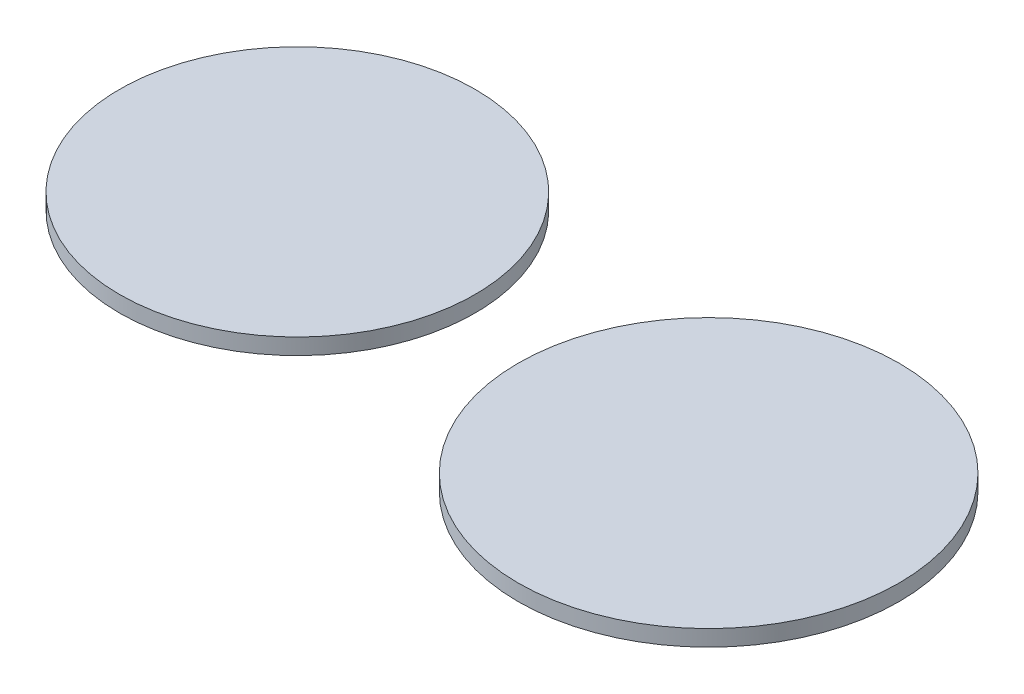
ISO-10303-21;
HEADER;
FILE_DESCRIPTION(('STEP AP214'),'2;1');
FILE_NAME('part.step','',(''),(''),'','','');
FILE_SCHEMA(('AUTOMOTIVE_DESIGN { 1 0 10303 214 1 1 1 1 }'));
ENDSEC;
DATA;
#1=APPLICATION_CONTEXT('core data for automotive mechanical design processes');
#2=APPLICATION_PROTOCOL_DEFINITION('international standard','automotive_design',2000,#1);
#3=PRODUCT_CONTEXT('',#1,'mechanical');
#4=PRODUCT('Part','Part','',(#3));
#5=PRODUCT_RELATED_PRODUCT_CATEGORY('part','',(#4));
#6=PRODUCT_DEFINITION_FORMATION('','',#4);
#7=PRODUCT_DEFINITION_CONTEXT('part definition',#1,'design');
#8=PRODUCT_DEFINITION('design','',#6,#7);
#9=PRODUCT_DEFINITION_SHAPE('','',#8);
#10=(LENGTH_UNIT() NAMED_UNIT(*) SI_UNIT(.MILLI.,.METRE.));
#11=(NAMED_UNIT(*) PLANE_ANGLE_UNIT() SI_UNIT($,.RADIAN.));
#12=(NAMED_UNIT(*) SI_UNIT($,.STERADIAN.) SOLID_ANGLE_UNIT());
#13=UNCERTAINTY_MEASURE_WITH_UNIT(LENGTH_MEASURE(1.E-05),#10,'distance_accuracy_value','');
#14=(GEOMETRIC_REPRESENTATION_CONTEXT(3) GLOBAL_UNCERTAINTY_ASSIGNED_CONTEXT((#13)) GLOBAL_UNIT_ASSIGNED_CONTEXT((#10,
#11,#12)) REPRESENTATION_CONTEXT('',''));
#15=CARTESIAN_POINT('',(0.,0.,0.));
#16=DIRECTION('',(0.,0.,1.));
#17=DIRECTION('',(1.,0.,0.));
#18=AXIS2_PLACEMENT_3D('',#15,#16,#17);
#19=CARTESIAN_POINT('',(-70.7553356851918,2.54,-5.9667612499652));
#20=DIRECTION('',(0.,-1.,0.));
#21=DIRECTION('',(0.,0.,-1.));
#22=AXIS2_PLACEMENT_3D('',#19,#20,#21);
#23=CYLINDRICAL_SURFACE('',#22,28.);
#24=CARTESIAN_POINT('',(-70.7553356851918,2.54,-5.9667612499652));
#25=DIRECTION('',(0.,1.,0.));
#26=DIRECTION('',(0.,0.,1.));
#27=AXIS2_PLACEMENT_3D('',#24,#25,#26);
#28=CIRCLE('',#27,28.);
#29=CARTESIAN_POINT('',(-70.7553356851918,2.54,22.0332387500348));
#30=VERTEX_POINT('',#29);
#31=EDGE_CURVE('E11',#30,#30,#28,.T.);
#32=ORIENTED_EDGE('',*,*,#31,.F.);
#33=EDGE_LOOP('',(#32));
#34=FACE_BOUND('',#33,.T.);
#35=CARTESIAN_POINT('',(-70.7553356851918,0.,-5.9667612499652));
#36=DIRECTION('',(0.,1.,0.));
#37=DIRECTION('',(0.,0.,1.));
#38=AXIS2_PLACEMENT_3D('',#35,#36,#37);
#39=CIRCLE('',#38,28.);
#40=CARTESIAN_POINT('',(-70.7553356851918,0.,22.0332387500348));
#41=VERTEX_POINT('',#40);
#42=EDGE_CURVE('E42',#41,#41,#39,.T.);
#43=ORIENTED_EDGE('',*,*,#42,.T.);
#44=EDGE_LOOP('',(#43));
#45=FACE_BOUND('',#44,.T.);
#46=ADVANCED_FACE('F39',(#34,#45),#23,.T.);
#47=CARTESIAN_POINT('',(-70.7553356851918,2.54,-5.9667612499652));
#48=DIRECTION('',(0.,1.,0.));
#49=DIRECTION('',(0.,0.,1.));
#50=AXIS2_PLACEMENT_3D('',#47,#48,#49);
#51=PLANE('',#50);
#52=ORIENTED_EDGE('',*,*,#31,.T.);
#53=EDGE_LOOP('',(#52));
#54=FACE_BOUND('',#53,.T.);
#55=ADVANCED_FACE('F54',(#54),#51,.T.);
#56=CARTESIAN_POINT('',(-70.7553356851918,0.,-5.9667612499652));
#57=DIRECTION('',(0.,1.,0.));
#58=DIRECTION('',(0.,0.,1.));
#59=AXIS2_PLACEMENT_3D('',#56,#57,#58);
#60=PLANE('',#59);
#61=ORIENTED_EDGE('',*,*,#42,.F.);
#62=EDGE_LOOP('',(#61));
#63=FACE_BOUND('',#62,.T.);
#64=ADVANCED_FACE('F52',(#63),#60,.F.);
#65=CLOSED_SHELL('',(#46,#55,#64));
#66=MANIFOLD_SOLID_BREP('B2',#65);
#67=CARTESIAN_POINT('',(0.,2.54,0.));
#68=DIRECTION('',(0.,-1.,0.));
#69=DIRECTION('',(0.,0.,-1.));
#70=AXIS2_PLACEMENT_3D('',#67,#68,#69);
#71=CYLINDRICAL_SURFACE('',#70,30.);
#72=CARTESIAN_POINT('',(0.,2.54,0.));
#73=DIRECTION('',(0.,1.,0.));
#74=DIRECTION('',(0.,0.,1.));
#75=AXIS2_PLACEMENT_3D('',#72,#73,#74);
#76=CIRCLE('',#75,30.);
#77=CARTESIAN_POINT('',(0.,2.54,30.));
#78=VERTEX_POINT('',#77);
#79=EDGE_CURVE('E38',#78,#78,#76,.T.);
#80=ORIENTED_EDGE('',*,*,#79,.F.);
#81=EDGE_LOOP('',(#80));
#82=FACE_BOUND('',#81,.T.);
#83=CARTESIAN_POINT('',(0.,0.,0.));
#84=DIRECTION('',(0.,1.,0.));
#85=DIRECTION('',(0.,0.,1.));
#86=AXIS2_PLACEMENT_3D('',#83,#84,#85);
#87=CIRCLE('',#86,30.);
#88=CARTESIAN_POINT('',(0.,0.,30.));
#89=VERTEX_POINT('',#88);
#90=EDGE_CURVE('E83',#89,#89,#87,.T.);
#91=ORIENTED_EDGE('',*,*,#90,.T.);
#92=EDGE_LOOP('',(#91));
#93=FACE_BOUND('',#92,.T.);
#94=ADVANCED_FACE('F80',(#82,#93),#71,.T.);
#95=CARTESIAN_POINT('',(0.,2.54,0.));
#96=DIRECTION('',(0.,1.,0.));
#97=DIRECTION('',(0.,0.,1.));
#98=AXIS2_PLACEMENT_3D('',#95,#96,#97);
#99=PLANE('',#98);
#100=ORIENTED_EDGE('',*,*,#79,.T.);
#101=EDGE_LOOP('',(#100));
#102=FACE_BOUND('',#101,.T.);
#103=ADVANCED_FACE('F95',(#102),#99,.T.);
#104=CARTESIAN_POINT('',(0.,0.,0.));
#105=DIRECTION('',(0.,1.,0.));
#106=DIRECTION('',(0.,0.,1.));
#107=AXIS2_PLACEMENT_3D('',#104,#105,#106);
#108=PLANE('',#107);
#109=ORIENTED_EDGE('',*,*,#90,.F.);
#110=EDGE_LOOP('',(#109));
#111=FACE_BOUND('',#110,.T.);
#112=ADVANCED_FACE('F93',(#111),#108,.F.);
#113=CLOSED_SHELL('',(#94,#103,#112));
#114=MANIFOLD_SOLID_BREP('B6',#113);
#115=ADVANCED_BREP_SHAPE_REPRESENTATION('',(#18,#66,#114),#14);
#116=SHAPE_DEFINITION_REPRESENTATION(#9,#115);
ENDSEC;
END-ISO-10303-21;
